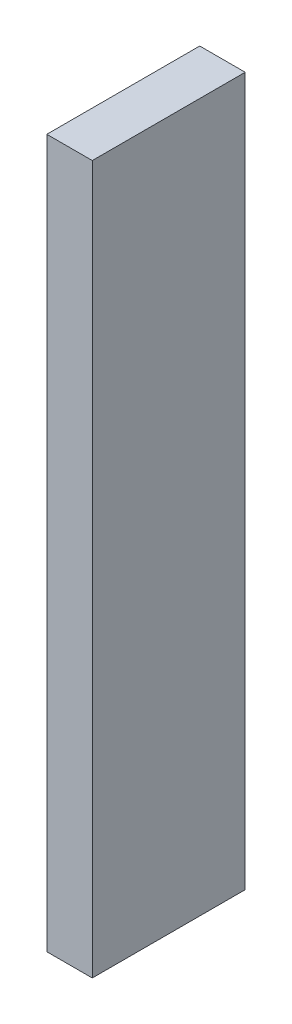
ISO-10303-21;
HEADER;
FILE_DESCRIPTION(('STEP AP214'),'2;1');
FILE_NAME('part.step','',(''),(''),'','','');
FILE_SCHEMA(('AUTOMOTIVE_DESIGN { 1 0 10303 214 1 1 1 1 }'));
ENDSEC;
DATA;
#1=APPLICATION_CONTEXT('core data for automotive mechanical design processes');
#2=APPLICATION_PROTOCOL_DEFINITION('international standard','automotive_design',2000,#1);
#3=PRODUCT_CONTEXT('',#1,'mechanical');
#4=PRODUCT('Part','Part','',(#3));
#5=PRODUCT_RELATED_PRODUCT_CATEGORY('part','',(#4));
#6=PRODUCT_DEFINITION_FORMATION('','',#4);
#7=PRODUCT_DEFINITION_CONTEXT('part definition',#1,'design');
#8=PRODUCT_DEFINITION('design','',#6,#7);
#9=PRODUCT_DEFINITION_SHAPE('','',#8);
#10=(LENGTH_UNIT() NAMED_UNIT(*) SI_UNIT(.MILLI.,.METRE.));
#11=(NAMED_UNIT(*) PLANE_ANGLE_UNIT() SI_UNIT($,.RADIAN.));
#12=(NAMED_UNIT(*) SI_UNIT($,.STERADIAN.) SOLID_ANGLE_UNIT());
#13=UNCERTAINTY_MEASURE_WITH_UNIT(LENGTH_MEASURE(1.E-05),#10,'distance_accuracy_value','');
#14=(GEOMETRIC_REPRESENTATION_CONTEXT(3) GLOBAL_UNCERTAINTY_ASSIGNED_CONTEXT((#13)) GLOBAL_UNIT_ASSIGNED_CONTEXT((#10,
#11,#12)) REPRESENTATION_CONTEXT('',''));
#15=CARTESIAN_POINT('',(0.,0.,0.));
#16=DIRECTION('',(0.,0.,1.));
#17=DIRECTION('',(1.,0.,0.));
#18=AXIS2_PLACEMENT_3D('',#15,#16,#17);
#19=CARTESIAN_POINT('',(130.27554525479,22.4180708263693,61.0720244776067));
#20=DIRECTION('',(-1.69244514382854E-09,0.,1.));
#21=DIRECTION('',(1.,0.,1.69244514382854E-09));
#22=AXIS2_PLACEMENT_3D('',#19,#20,#21);
#23=PLANE('',#22);
#24=DIRECTION('',(0.,-1.,0.));
#25=VECTOR('',#24,1.);
#26=CARTESIAN_POINT('',(131.258630351803,22.4180708263693,61.0720244792706));
#27=LINE('',#26,#25);
#28=CARTESIAN_POINT('',(131.258630351803,22.4180708263693,61.0720244792706));
#29=VERTEX_POINT('',#28);
#30=CARTESIAN_POINT('',(131.258630351803,7.11212965552236,61.0720244792705));
#31=VERTEX_POINT('',#30);
#32=EDGE_CURVE('E79',#29,#31,#27,.T.);
#33=ORIENTED_EDGE('',*,*,#32,.F.);
#34=DIRECTION('',(1.,0.,1.69244514382854E-09));
#35=VECTOR('',#34,1.);
#36=CARTESIAN_POINT('',(130.27554525479,22.4180708263693,61.0720244776067));
#37=LINE('',#36,#35);
#38=CARTESIAN_POINT('',(130.27554525479,22.4180708263693,61.0720244776067));
#39=VERTEX_POINT('',#38);
#40=EDGE_CURVE('E32',#39,#29,#37,.T.);
#41=ORIENTED_EDGE('',*,*,#40,.F.);
#42=DIRECTION('',(0.,-1.,0.));
#43=VECTOR('',#42,1.);
#44=CARTESIAN_POINT('',(130.27554525479,22.4180708263693,61.0720244776067));
#45=LINE('',#44,#43);
#46=CARTESIAN_POINT('',(130.27554525479,7.11212965552236,61.0720244776067));
#47=VERTEX_POINT('',#46);
#48=EDGE_CURVE('E71',#39,#47,#45,.T.);
#49=ORIENTED_EDGE('',*,*,#48,.T.);
#50=DIRECTION('',(1.,0.,1.69244514382854E-09));
#51=VECTOR('',#50,1.);
#52=CARTESIAN_POINT('',(130.27554525479,7.11212965552236,61.0720244776067));
#53=LINE('',#52,#51);
#54=EDGE_CURVE('E10',#47,#31,#53,.T.);
#55=ORIENTED_EDGE('',*,*,#54,.T.);
#56=EDGE_LOOP('',(#33,#41,#49,#55));
#57=FACE_BOUND('',#56,.T.);
#58=ADVANCED_FACE('F16',(#57),#23,.T.);
#59=CARTESIAN_POINT('',(130.27554525479,7.11212965552236,61.0720244776067));
#60=DIRECTION('',(0.,-1.,0.));
#61=DIRECTION('',(0.,0.,-1.));
#62=AXIS2_PLACEMENT_3D('',#59,#60,#61);
#63=PLANE('',#62);
#64=DIRECTION('',(1.69244514382854E-09,0.,-1.));
#65=VECTOR('',#64,1.);
#66=CARTESIAN_POINT('',(131.258630351803,7.11212965552236,61.0720244792705));
#67=LINE('',#66,#65);
#68=CARTESIAN_POINT('',(131.258630357398,7.11212965552235,57.7660833084218));
#69=VERTEX_POINT('',#68);
#70=EDGE_CURVE('E82',#31,#69,#67,.T.);
#71=ORIENTED_EDGE('',*,*,#70,.F.);
#72=ORIENTED_EDGE('',*,*,#54,.F.);
#73=DIRECTION('',(1.69244514382854E-09,0.,-1.));
#74=VECTOR('',#73,1.);
#75=CARTESIAN_POINT('',(130.27554525479,7.11212965552236,61.0720244776067));
#76=LINE('',#75,#74);
#77=CARTESIAN_POINT('',(130.275545260385,7.11212965552235,57.766083306758));
#78=VERTEX_POINT('',#77);
#79=EDGE_CURVE('E67',#47,#78,#76,.T.);
#80=ORIENTED_EDGE('',*,*,#79,.T.);
#81=DIRECTION('',(1.,0.,1.69244514382854E-09));
#82=VECTOR('',#81,1.);
#83=CARTESIAN_POINT('',(130.275545260385,7.11212965552235,57.766083306758));
#84=LINE('',#83,#82);
#85=EDGE_CURVE('E24',#78,#69,#84,.T.);
#86=ORIENTED_EDGE('',*,*,#85,.T.);
#87=EDGE_LOOP('',(#71,#72,#80,#86));
#88=FACE_BOUND('',#87,.T.);
#89=ADVANCED_FACE('F68',(#88),#63,.T.);
#90=CARTESIAN_POINT('',(130.275545260385,7.11212965552235,57.766083306758));
#91=DIRECTION('',(1.69244514382854E-09,0.,-1.));
#92=DIRECTION('',(-1.,0.,-1.69244514382854E-09));
#93=AXIS2_PLACEMENT_3D('',#90,#91,#92);
#94=PLANE('',#93);
#95=DIRECTION('',(0.,1.,0.));
#96=VECTOR('',#95,1.);
#97=CARTESIAN_POINT('',(131.258630357398,7.11212965552235,57.7660833084218));
#98=LINE('',#97,#96);
#99=CARTESIAN_POINT('',(131.258630357398,22.418070826371,57.7660832999612));
#100=VERTEX_POINT('',#99);
#101=EDGE_CURVE('E65',#69,#100,#98,.T.);
#102=ORIENTED_EDGE('',*,*,#101,.F.);
#103=ORIENTED_EDGE('',*,*,#85,.F.);
#104=DIRECTION('',(0.,1.,0.));
#105=VECTOR('',#104,1.);
#106=CARTESIAN_POINT('',(130.275545260385,7.11212965552235,57.766083306758));
#107=LINE('',#106,#105);
#108=CARTESIAN_POINT('',(130.275545260385,22.418070826371,57.7660832982974));
#109=VERTEX_POINT('',#108);
#110=EDGE_CURVE('E62',#78,#109,#107,.T.);
#111=ORIENTED_EDGE('',*,*,#110,.T.);
#112=DIRECTION('',(1.,0.,1.69244514382854E-09));
#113=VECTOR('',#112,1.);
#114=CARTESIAN_POINT('',(130.275545260385,22.418070826371,57.7660832982974));
#115=LINE('',#114,#113);
#116=EDGE_CURVE('E48',#109,#100,#115,.T.);
#117=ORIENTED_EDGE('',*,*,#116,.T.);
#118=EDGE_LOOP('',(#102,#103,#111,#117));
#119=FACE_BOUND('',#118,.T.);
#120=ADVANCED_FACE('F60',(#119),#94,.T.);
#121=CARTESIAN_POINT('',(130.275545260385,22.418070826371,57.7660832982974));
#122=DIRECTION('',(0.,1.,0.));
#123=DIRECTION('',(-1.,0.,0.));
#124=AXIS2_PLACEMENT_3D('',#121,#122,#123);
#125=PLANE('',#124);
#126=DIRECTION('',(-1.69244514382854E-09,0.,1.));
#127=VECTOR('',#126,1.);
#128=CARTESIAN_POINT('',(131.258630357398,22.418070826371,57.7660832999612));
#129=LINE('',#128,#127);
#130=EDGE_CURVE('E85',#100,#29,#129,.T.);
#131=ORIENTED_EDGE('',*,*,#130,.F.);
#132=ORIENTED_EDGE('',*,*,#116,.F.);
#133=DIRECTION('',(-1.69244514382854E-09,0.,1.));
#134=VECTOR('',#133,1.);
#135=CARTESIAN_POINT('',(130.275545260385,22.418070826371,57.7660832982974));
#136=LINE('',#135,#134);
#137=EDGE_CURVE('E74',#109,#39,#136,.T.);
#138=ORIENTED_EDGE('',*,*,#137,.T.);
#139=ORIENTED_EDGE('',*,*,#40,.T.);
#140=EDGE_LOOP('',(#131,#132,#138,#139));
#141=FACE_BOUND('',#140,.T.);
#142=ADVANCED_FACE('F96',(#141),#125,.T.);
#143=CARTESIAN_POINT('',(130.275545201028,17.2651002409467,92.8378607087388));
#144=DIRECTION('',(1.,0.,1.69244514382854E-09));
#145=DIRECTION('',(0.,1.,0.));
#146=AXIS2_PLACEMENT_3D('',#143,#144,#145);
#147=PLANE('',#146);
#148=ORIENTED_EDGE('',*,*,#48,.F.);
#149=ORIENTED_EDGE('',*,*,#137,.F.);
#150=ORIENTED_EDGE('',*,*,#110,.F.);
#151=ORIENTED_EDGE('',*,*,#79,.F.);
#152=EDGE_LOOP('',(#148,#149,#150,#151));
#153=FACE_BOUND('',#152,.T.);
#154=ADVANCED_FACE('F73',(#153),#147,.F.);
#155=CARTESIAN_POINT('',(131.258630298041,17.2651002409467,92.8378607104026));
#156=DIRECTION('',(1.,0.,1.69244514382854E-09));
#157=DIRECTION('',(0.,1.,0.));
#158=AXIS2_PLACEMENT_3D('',#155,#156,#157);
#159=PLANE('',#158);
#160=ORIENTED_EDGE('',*,*,#32,.T.);
#161=ORIENTED_EDGE('',*,*,#70,.T.);
#162=ORIENTED_EDGE('',*,*,#101,.T.);
#163=ORIENTED_EDGE('',*,*,#130,.T.);
#164=EDGE_LOOP('',(#160,#161,#162,#163));
#165=FACE_BOUND('',#164,.T.);
#166=ADVANCED_FACE('F89',(#165),#159,.T.);
#167=CLOSED_SHELL('',(#58,#89,#120,#142,#154,#166));
#168=MANIFOLD_SOLID_BREP('B1',#167);
#169=ADVANCED_BREP_SHAPE_REPRESENTATION('',(#18,#168),#14);
#170=SHAPE_DEFINITION_REPRESENTATION(#9,#169);
ENDSEC;
END-ISO-10303-21;
